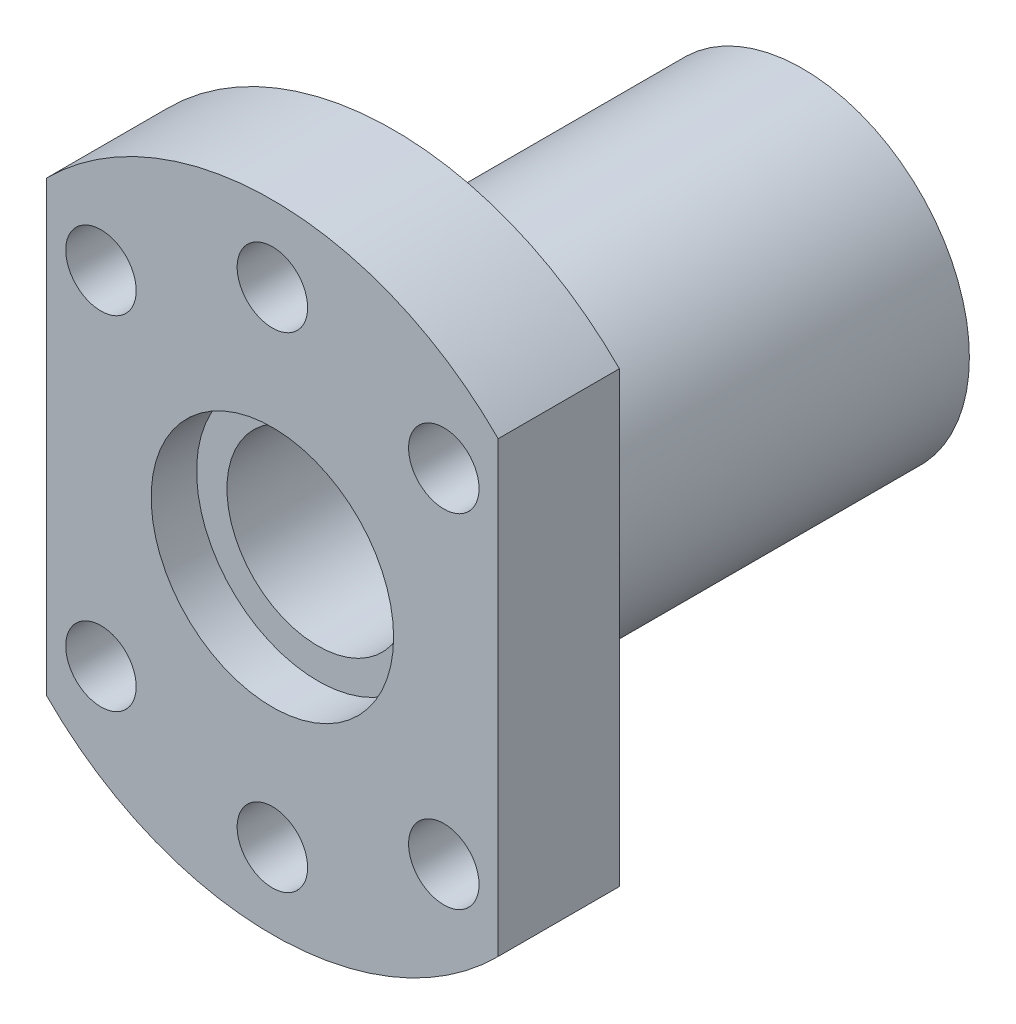
ISO-10303-21;
HEADER;
FILE_DESCRIPTION(('STEP AP214'),'2;1');
FILE_NAME('part.step','',(''),(''),'','','');
FILE_SCHEMA(('AUTOMOTIVE_DESIGN { 1 0 10303 214 1 1 1 1 }'));
ENDSEC;
DATA;
#1=APPLICATION_CONTEXT('core data for automotive mechanical design processes');
#2=APPLICATION_PROTOCOL_DEFINITION('international standard','automotive_design',2000,#1);
#3=PRODUCT_CONTEXT('',#1,'mechanical');
#4=PRODUCT('Part','Part','',(#3));
#5=PRODUCT_RELATED_PRODUCT_CATEGORY('part','',(#4));
#6=PRODUCT_DEFINITION_FORMATION('','',#4);
#7=PRODUCT_DEFINITION_CONTEXT('part definition',#1,'design');
#8=PRODUCT_DEFINITION('design','',#6,#7);
#9=PRODUCT_DEFINITION_SHAPE('','',#8);
#10=(LENGTH_UNIT() NAMED_UNIT(*) SI_UNIT(.MILLI.,.METRE.));
#11=(NAMED_UNIT(*) PLANE_ANGLE_UNIT() SI_UNIT($,.RADIAN.));
#12=(NAMED_UNIT(*) SI_UNIT($,.STERADIAN.) SOLID_ANGLE_UNIT());
#13=UNCERTAINTY_MEASURE_WITH_UNIT(LENGTH_MEASURE(1.E-05),#10,'distance_accuracy_value','');
#14=(GEOMETRIC_REPRESENTATION_CONTEXT(3) GLOBAL_UNCERTAINTY_ASSIGNED_CONTEXT((#13)) GLOBAL_UNIT_ASSIGNED_CONTEXT((#10,
#11,#12)) REPRESENTATION_CONTEXT('',''));
#15=CARTESIAN_POINT('',(0.,0.,0.));
#16=DIRECTION('',(0.,0.,1.));
#17=DIRECTION('',(1.,0.,0.));
#18=AXIS2_PLACEMENT_3D('',#15,#16,#17);
#19=CARTESIAN_POINT('',(0.,0.,27.));
#20=DIRECTION('',(0.,0.,1.));
#21=DIRECTION('',(1.,0.,0.));
#22=AXIS2_PLACEMENT_3D('',#19,#20,#21);
#23=CYLINDRICAL_SURFACE('',#22,21.);
#24=CARTESIAN_POINT('',(0.,0.,9.5));
#25=DIRECTION('',(0.,0.,1.));
#26=DIRECTION('',(1.,0.,0.));
#27=AXIS2_PLACEMENT_3D('',#24,#25,#26);
#28=CIRCLE('',#27,21.);
#29=CARTESIAN_POINT('',(-14.9,-14.7983107144025,9.5));
#30=VERTEX_POINT('',#29);
#31=CARTESIAN_POINT('',(14.9,-14.7983107144025,9.5));
#32=VERTEX_POINT('',#31);
#33=EDGE_CURVE('E93',#30,#32,#28,.T.);
#34=ORIENTED_EDGE('',*,*,#33,.T.);
#35=DIRECTION('',(0.,0.,1.));
#36=VECTOR('',#35,1.);
#37=CARTESIAN_POINT('',(14.9,-14.7983107144025,27.));
#38=LINE('',#37,#36);
#39=CARTESIAN_POINT('',(14.9,-14.7983107144025,17.5));
#40=VERTEX_POINT('',#39);
#41=EDGE_CURVE('E54',#32,#40,#38,.T.);
#42=ORIENTED_EDGE('',*,*,#41,.T.);
#43=CARTESIAN_POINT('',(0.,0.,17.5));
#44=DIRECTION('',(0.,0.,1.));
#45=DIRECTION('',(1.,0.,0.));
#46=AXIS2_PLACEMENT_3D('',#43,#44,#45);
#47=CIRCLE('',#46,21.);
#48=CARTESIAN_POINT('',(-14.9,-14.7983107144025,17.5));
#49=VERTEX_POINT('',#48);
#50=EDGE_CURVE('E91',#49,#40,#47,.T.);
#51=ORIENTED_EDGE('',*,*,#50,.F.);
#52=DIRECTION('',(0.,0.,1.));
#53=VECTOR('',#52,1.);
#54=CARTESIAN_POINT('',(-14.9,-14.7983107144025,27.));
#55=LINE('',#54,#53);
#56=EDGE_CURVE('E153',#49,#30,#55,.F.);
#57=ORIENTED_EDGE('',*,*,#56,.T.);
#58=EDGE_LOOP('',(#34,#42,#51,#57));
#59=FACE_BOUND('',#58,.T.);
#60=ADVANCED_FACE('F37',(#59),#23,.T.);
#61=CARTESIAN_POINT('',(0.,11.,-17.5));
#62=DIRECTION('',(0.,0.,1.));
#63=DIRECTION('',(1.,0.,0.));
#64=AXIS2_PLACEMENT_3D('',#61,#62,#63);
#65=PLANE('',#64);
#66=CARTESIAN_POINT('',(0.,0.,-17.5));
#67=DIRECTION('',(0.,0.,1.));
#68=DIRECTION('',(1.,0.,0.));
#69=AXIS2_PLACEMENT_3D('',#66,#67,#68);
#70=CIRCLE('',#69,11.);
#71=CARTESIAN_POINT('',(11.,0.,-17.5));
#72=VERTEX_POINT('',#71);
#73=EDGE_CURVE('E157',#72,#72,#70,.T.);
#74=ORIENTED_EDGE('',*,*,#73,.F.);
#75=EDGE_LOOP('',(#74));
#76=FACE_BOUND('',#75,.T.);
#77=CARTESIAN_POINT('',(0.,0.,-17.5));
#78=DIRECTION('',(0.,0.,1.));
#79=DIRECTION('',(1.,0.,0.));
#80=AXIS2_PLACEMENT_3D('',#77,#78,#79);
#81=CIRCLE('',#80,8.);
#82=CARTESIAN_POINT('',(8.,0.,-17.5));
#83=VERTEX_POINT('',#82);
#84=EDGE_CURVE('E119',#83,#83,#81,.T.);
#85=ORIENTED_EDGE('',*,*,#84,.T.);
#86=EDGE_LOOP('',(#85));
#87=FACE_BOUND('',#86,.T.);
#88=ADVANCED_FACE('F39',(#76,#87),#65,.F.);
#89=CARTESIAN_POINT('',(0.,0.,27.));
#90=DIRECTION('',(0.,0.,1.));
#91=DIRECTION('',(1.,0.,0.));
#92=AXIS2_PLACEMENT_3D('',#89,#90,#91);
#93=CYLINDRICAL_SURFACE('',#92,8.);
#94=ORIENTED_EDGE('',*,*,#84,.F.);
#95=EDGE_LOOP('',(#94));
#96=FACE_BOUND('',#95,.T.);
#97=CARTESIAN_POINT('',(0.,0.,-14.5));
#98=DIRECTION('',(0.,0.,1.));
#99=DIRECTION('',(1.,0.,0.));
#100=AXIS2_PLACEMENT_3D('',#97,#98,#99);
#101=CIRCLE('',#100,8.);
#102=CARTESIAN_POINT('',(8.,0.,-14.5));
#103=VERTEX_POINT('',#102);
#104=EDGE_CURVE('E116',#103,#103,#101,.T.);
#105=ORIENTED_EDGE('',*,*,#104,.T.);
#106=EDGE_LOOP('',(#105));
#107=FACE_BOUND('',#106,.T.);
#108=ADVANCED_FACE('F174',(#96,#107),#93,.F.);
#109=CARTESIAN_POINT('',(0.,6.,-14.5));
#110=DIRECTION('',(0.,0.,1.));
#111=DIRECTION('',(1.,0.,0.));
#112=AXIS2_PLACEMENT_3D('',#109,#110,#111);
#113=PLANE('',#112);
#114=ORIENTED_EDGE('',*,*,#104,.F.);
#115=EDGE_LOOP('',(#114));
#116=FACE_BOUND('',#115,.T.);
#117=CARTESIAN_POINT('',(0.,0.,-14.5));
#118=DIRECTION('',(0.,0.,1.));
#119=DIRECTION('',(1.,0.,0.));
#120=AXIS2_PLACEMENT_3D('',#117,#118,#119);
#121=CIRCLE('',#120,6.);
#122=CARTESIAN_POINT('',(6.,0.,-14.5));
#123=VERTEX_POINT('',#122);
#124=EDGE_CURVE('E113',#123,#123,#121,.T.);
#125=ORIENTED_EDGE('',*,*,#124,.T.);
#126=EDGE_LOOP('',(#125));
#127=FACE_BOUND('',#126,.T.);
#128=ADVANCED_FACE('F179',(#116,#127),#113,.F.);
#129=CARTESIAN_POINT('',(0.,0.,27.));
#130=DIRECTION('',(0.,0.,1.));
#131=DIRECTION('',(1.,0.,0.));
#132=AXIS2_PLACEMENT_3D('',#129,#130,#131);
#133=CYLINDRICAL_SURFACE('',#132,6.);
#134=ORIENTED_EDGE('',*,*,#124,.F.);
#135=EDGE_LOOP('',(#134));
#136=FACE_BOUND('',#135,.T.);
#137=CARTESIAN_POINT('',(0.,0.,14.5));
#138=DIRECTION('',(0.,0.,1.));
#139=DIRECTION('',(1.,0.,0.));
#140=AXIS2_PLACEMENT_3D('',#137,#138,#139);
#141=CIRCLE('',#140,6.);
#142=CARTESIAN_POINT('',(6.,0.,14.5));
#143=VERTEX_POINT('',#142);
#144=EDGE_CURVE('E110',#143,#143,#141,.T.);
#145=ORIENTED_EDGE('',*,*,#144,.T.);
#146=EDGE_LOOP('',(#145));
#147=FACE_BOUND('',#146,.T.);
#148=ADVANCED_FACE('F184',(#136,#147),#133,.F.);
#149=CARTESIAN_POINT('',(0.,6.,14.5));
#150=DIRECTION('',(0.,0.,-1.));
#151=DIRECTION('',(-1.,0.,0.));
#152=AXIS2_PLACEMENT_3D('',#149,#150,#151);
#153=PLANE('',#152);
#154=ORIENTED_EDGE('',*,*,#144,.F.);
#155=EDGE_LOOP('',(#154));
#156=FACE_BOUND('',#155,.T.);
#157=CARTESIAN_POINT('',(0.,0.,14.5));
#158=DIRECTION('',(0.,0.,1.));
#159=DIRECTION('',(1.,0.,0.));
#160=AXIS2_PLACEMENT_3D('',#157,#158,#159);
#161=CIRCLE('',#160,8.);
#162=CARTESIAN_POINT('',(8.,0.,14.5));
#163=VERTEX_POINT('',#162);
#164=EDGE_CURVE('E103',#163,#163,#161,.T.);
#165=ORIENTED_EDGE('',*,*,#164,.T.);
#166=EDGE_LOOP('',(#165));
#167=FACE_BOUND('',#166,.T.);
#168=ADVANCED_FACE('F190',(#156,#167),#153,.F.);
#169=CARTESIAN_POINT('',(0.,0.,27.));
#170=DIRECTION('',(0.,0.,1.));
#171=DIRECTION('',(1.,0.,0.));
#172=AXIS2_PLACEMENT_3D('',#169,#170,#171);
#173=CYLINDRICAL_SURFACE('',#172,8.);
#174=ORIENTED_EDGE('',*,*,#164,.F.);
#175=EDGE_LOOP('',(#174));
#176=FACE_BOUND('',#175,.T.);
#177=CARTESIAN_POINT('',(0.,0.,17.5));
#178=DIRECTION('',(0.,0.,1.));
#179=DIRECTION('',(1.,0.,0.));
#180=AXIS2_PLACEMENT_3D('',#177,#178,#179);
#181=CIRCLE('',#180,8.);
#182=CARTESIAN_POINT('',(8.,0.,17.5));
#183=VERTEX_POINT('',#182);
#184=EDGE_CURVE('E99',#183,#183,#181,.T.);
#185=ORIENTED_EDGE('',*,*,#184,.T.);
#186=EDGE_LOOP('',(#185));
#187=FACE_BOUND('',#186,.T.);
#188=ADVANCED_FACE('F196',(#176,#187),#173,.F.);
#189=CARTESIAN_POINT('',(0.,8.,17.5));
#190=DIRECTION('',(0.,0.,-1.));
#191=DIRECTION('',(-1.,0.,0.));
#192=AXIS2_PLACEMENT_3D('',#189,#190,#191);
#193=PLANE('',#192);
#194=CARTESIAN_POINT('',(11.3137084989848,11.3137084989848,17.5));
#195=DIRECTION('',(0.,0.,1.));
#196=DIRECTION('',(1.,0.,0.));
#197=AXIS2_PLACEMENT_3D('',#194,#195,#196);
#198=CIRCLE('',#197,2.325);
#199=CARTESIAN_POINT('',(13.6387084989848,11.3137084989848,17.5));
#200=VERTEX_POINT('',#199);
#201=EDGE_CURVE('E131',#200,#200,#198,.T.);
#202=ORIENTED_EDGE('',*,*,#201,.F.);
#203=EDGE_LOOP('',(#202));
#204=FACE_BOUND('',#203,.T.);
#205=CARTESIAN_POINT('',(11.3137084989848,-11.3137084989848,17.5));
#206=DIRECTION('',(0.,0.,1.));
#207=DIRECTION('',(1.,0.,0.));
#208=AXIS2_PLACEMENT_3D('',#205,#206,#207);
#209=CIRCLE('',#208,2.325);
#210=CARTESIAN_POINT('',(13.6387084989848,-11.3137084989848,17.5));
#211=VERTEX_POINT('',#210);
#212=EDGE_CURVE('E252',#211,#211,#209,.T.);
#213=ORIENTED_EDGE('',*,*,#212,.F.);
#214=EDGE_LOOP('',(#213));
#215=FACE_BOUND('',#214,.T.);
#216=CARTESIAN_POINT('',(0.,-16.,17.5));
#217=DIRECTION('',(0.,0.,1.));
#218=DIRECTION('',(1.,0.,0.));
#219=AXIS2_PLACEMENT_3D('',#216,#217,#218);
#220=CIRCLE('',#219,2.325);
#221=CARTESIAN_POINT('',(2.325,-16.,17.5));
#222=VERTEX_POINT('',#221);
#223=EDGE_CURVE('E255',#222,#222,#220,.T.);
#224=ORIENTED_EDGE('',*,*,#223,.F.);
#225=EDGE_LOOP('',(#224));
#226=FACE_BOUND('',#225,.T.);
#227=CARTESIAN_POINT('',(-11.3137084989848,-11.3137084989848,17.5));
#228=DIRECTION('',(0.,0.,1.));
#229=DIRECTION('',(1.,0.,0.));
#230=AXIS2_PLACEMENT_3D('',#227,#228,#229);
#231=CIRCLE('',#230,2.325);
#232=CARTESIAN_POINT('',(-8.98870849898476,-11.3137084989848,17.5));
#233=VERTEX_POINT('',#232);
#234=EDGE_CURVE('E259',#233,#233,#231,.T.);
#235=ORIENTED_EDGE('',*,*,#234,.F.);
#236=EDGE_LOOP('',(#235));
#237=FACE_BOUND('',#236,.T.);
#238=CARTESIAN_POINT('',(-11.3137084989848,11.3137084989848,17.5));
#239=DIRECTION('',(0.,0.,1.));
#240=DIRECTION('',(1.,0.,0.));
#241=AXIS2_PLACEMENT_3D('',#238,#239,#240);
#242=CIRCLE('',#241,2.325);
#243=CARTESIAN_POINT('',(-8.98870849898476,11.3137084989848,17.5));
#244=VERTEX_POINT('',#243);
#245=EDGE_CURVE('E148',#244,#244,#242,.T.);
#246=ORIENTED_EDGE('',*,*,#245,.F.);
#247=EDGE_LOOP('',(#246));
#248=FACE_BOUND('',#247,.T.);
#249=CARTESIAN_POINT('',(0.,16.,17.5));
#250=DIRECTION('',(0.,0.,1.));
#251=DIRECTION('',(1.,0.,0.));
#252=AXIS2_PLACEMENT_3D('',#249,#250,#251);
#253=CIRCLE('',#252,2.325);
#254=CARTESIAN_POINT('',(2.325,16.,17.5));
#255=VERTEX_POINT('',#254);
#256=EDGE_CURVE('E126',#255,#255,#253,.T.);
#257=ORIENTED_EDGE('',*,*,#256,.F.);
#258=EDGE_LOOP('',(#257));
#259=FACE_BOUND('',#258,.T.);
#260=ORIENTED_EDGE('',*,*,#184,.F.);
#261=EDGE_LOOP('',(#260));
#262=FACE_BOUND('',#261,.T.);
#263=ORIENTED_EDGE('',*,*,#50,.T.);
#264=DIRECTION('',(0.,1.,0.));
#265=VECTOR('',#264,1.);
#266=CARTESIAN_POINT('',(14.9,-21.,17.5));
#267=LINE('',#266,#265);
#268=CARTESIAN_POINT('',(14.9,14.7983107144025,17.5));
#269=VERTEX_POINT('',#268);
#270=EDGE_CURVE('E79',#40,#269,#267,.T.);
#271=ORIENTED_EDGE('',*,*,#270,.T.);
#272=CARTESIAN_POINT('',(-14.9,14.7983107144025,17.5));
#273=VERTEX_POINT('',#272);
#274=EDGE_CURVE('E100',#269,#273,#47,.T.);
#275=ORIENTED_EDGE('',*,*,#274,.T.);
#276=DIRECTION('',(0.,1.,0.));
#277=VECTOR('',#276,1.);
#278=CARTESIAN_POINT('',(-14.9,-21.,17.5));
#279=LINE('',#278,#277);
#280=EDGE_CURVE('E94',#49,#273,#279,.T.);
#281=ORIENTED_EDGE('',*,*,#280,.F.);
#282=EDGE_LOOP('',(#263,#271,#275,#281));
#283=FACE_BOUND('',#282,.T.);
#284=ADVANCED_FACE('F97',(#204,#215,#226,#237,#248,#259,#262,#283),#193,.F.);
#285=ORIENTED_EDGE('',*,*,#274,.F.);
#286=DIRECTION('',(0.,0.,1.));
#287=VECTOR('',#286,1.);
#288=CARTESIAN_POINT('',(14.9,14.7983107144025,27.));
#289=LINE('',#288,#287);
#290=CARTESIAN_POINT('',(14.9,14.7983107144025,9.5));
#291=VERTEX_POINT('',#290);
#292=EDGE_CURVE('E81',#269,#291,#289,.F.);
#293=ORIENTED_EDGE('',*,*,#292,.T.);
#294=CARTESIAN_POINT('',(-14.9,14.7983107144025,9.5));
#295=VERTEX_POINT('',#294);
#296=EDGE_CURVE('E61',#291,#295,#28,.T.);
#297=ORIENTED_EDGE('',*,*,#296,.T.);
#298=DIRECTION('',(0.,0.,1.));
#299=VECTOR('',#298,1.);
#300=CARTESIAN_POINT('',(-14.9,14.7983107144025,27.));
#301=LINE('',#300,#299);
#302=EDGE_CURVE('E155',#295,#273,#301,.T.);
#303=ORIENTED_EDGE('',*,*,#302,.T.);
#304=EDGE_LOOP('',(#285,#293,#297,#303));
#305=FACE_BOUND('',#304,.T.);
#306=ADVANCED_FACE('F206',(#305),#23,.T.);
#307=CARTESIAN_POINT('',(0.,21.,9.5));
#308=DIRECTION('',(0.,0.,1.));
#309=DIRECTION('',(1.,0.,0.));
#310=AXIS2_PLACEMENT_3D('',#307,#308,#309);
#311=PLANE('',#310);
#312=CARTESIAN_POINT('',(11.3137084989848,11.3137084989848,9.5));
#313=DIRECTION('',(0.,0.,1.));
#314=DIRECTION('',(1.,0.,0.));
#315=AXIS2_PLACEMENT_3D('',#312,#313,#314);
#316=CIRCLE('',#315,2.325);
#317=CARTESIAN_POINT('',(13.6387084989848,11.3137084989848,9.5));
#318=VERTEX_POINT('',#317);
#319=EDGE_CURVE('E41',#318,#318,#316,.T.);
#320=ORIENTED_EDGE('',*,*,#319,.T.);
#321=EDGE_LOOP('',(#320));
#322=FACE_BOUND('',#321,.T.);
#323=CARTESIAN_POINT('',(11.3137084989848,-11.3137084989848,9.5));
#324=DIRECTION('',(0.,0.,1.));
#325=DIRECTION('',(1.,0.,0.));
#326=AXIS2_PLACEMENT_3D('',#323,#324,#325);
#327=CIRCLE('',#326,2.325);
#328=CARTESIAN_POINT('',(13.6387084989848,-11.3137084989848,9.5));
#329=VERTEX_POINT('',#328);
#330=EDGE_CURVE('E136',#329,#329,#327,.T.);
#331=ORIENTED_EDGE('',*,*,#330,.T.);
#332=EDGE_LOOP('',(#331));
#333=FACE_BOUND('',#332,.T.);
#334=CARTESIAN_POINT('',(0.,-16.,9.5));
#335=DIRECTION('',(0.,0.,1.));
#336=DIRECTION('',(1.,0.,0.));
#337=AXIS2_PLACEMENT_3D('',#334,#335,#336);
#338=CIRCLE('',#337,2.325);
#339=CARTESIAN_POINT('',(2.325,-16.,9.5));
#340=VERTEX_POINT('',#339);
#341=EDGE_CURVE('E134',#340,#340,#338,.T.);
#342=ORIENTED_EDGE('',*,*,#341,.T.);
#343=EDGE_LOOP('',(#342));
#344=FACE_BOUND('',#343,.T.);
#345=CARTESIAN_POINT('',(-11.3137084989848,-11.3137084989848,9.5));
#346=DIRECTION('',(0.,0.,1.));
#347=DIRECTION('',(1.,0.,0.));
#348=AXIS2_PLACEMENT_3D('',#345,#346,#347);
#349=CIRCLE('',#348,2.325);
#350=CARTESIAN_POINT('',(-8.98870849898476,-11.3137084989848,9.5));
#351=VERTEX_POINT('',#350);
#352=EDGE_CURVE('E130',#351,#351,#349,.T.);
#353=ORIENTED_EDGE('',*,*,#352,.T.);
#354=EDGE_LOOP('',(#353));
#355=FACE_BOUND('',#354,.T.);
#356=CARTESIAN_POINT('',(-11.3137084989848,11.3137084989848,9.5));
#357=DIRECTION('',(0.,0.,1.));
#358=DIRECTION('',(1.,0.,0.));
#359=AXIS2_PLACEMENT_3D('',#356,#357,#358);
#360=CIRCLE('',#359,2.325);
#361=CARTESIAN_POINT('',(-8.98870849898476,11.3137084989848,9.5));
#362=VERTEX_POINT('',#361);
#363=EDGE_CURVE('E127',#362,#362,#360,.T.);
#364=ORIENTED_EDGE('',*,*,#363,.T.);
#365=EDGE_LOOP('',(#364));
#366=FACE_BOUND('',#365,.T.);
#367=CARTESIAN_POINT('',(0.,16.,9.5));
#368=DIRECTION('',(0.,0.,1.));
#369=DIRECTION('',(1.,0.,0.));
#370=AXIS2_PLACEMENT_3D('',#367,#368,#369);
#371=CIRCLE('',#370,2.325);
#372=CARTESIAN_POINT('',(2.325,16.,9.5));
#373=VERTEX_POINT('',#372);
#374=EDGE_CURVE('E85',#373,#373,#371,.T.);
#375=ORIENTED_EDGE('',*,*,#374,.T.);
#376=EDGE_LOOP('',(#375));
#377=FACE_BOUND('',#376,.T.);
#378=ORIENTED_EDGE('',*,*,#296,.F.);
#379=DIRECTION('',(0.,-1.,0.));
#380=VECTOR('',#379,1.);
#381=CARTESIAN_POINT('',(14.9,21.,9.5));
#382=LINE('',#381,#380);
#383=EDGE_CURVE('E11',#291,#32,#382,.T.);
#384=ORIENTED_EDGE('',*,*,#383,.T.);
#385=ORIENTED_EDGE('',*,*,#33,.F.);
#386=DIRECTION('',(0.,1.,0.));
#387=VECTOR('',#386,1.);
#388=CARTESIAN_POINT('',(-14.9,21.,9.5));
#389=LINE('',#388,#387);
#390=EDGE_CURVE('E46',#30,#295,#389,.T.);
#391=ORIENTED_EDGE('',*,*,#390,.T.);
#392=EDGE_LOOP('',(#378,#384,#385,#391));
#393=FACE_BOUND('',#392,.T.);
#394=CARTESIAN_POINT('',(0.,0.,9.5));
#395=DIRECTION('',(0.,0.,1.));
#396=DIRECTION('',(1.,0.,0.));
#397=AXIS2_PLACEMENT_3D('',#394,#395,#396);
#398=CIRCLE('',#397,11.);
#399=CARTESIAN_POINT('',(11.,0.,9.5));
#400=VERTEX_POINT('',#399);
#401=EDGE_CURVE('E159',#400,#400,#398,.T.);
#402=ORIENTED_EDGE('',*,*,#401,.T.);
#403=EDGE_LOOP('',(#402));
#404=FACE_BOUND('',#403,.T.);
#405=ADVANCED_FACE('F163',(#322,#333,#344,#355,#366,#377,#393,#404),#311,.F.);
#406=CARTESIAN_POINT('',(0.,0.,27.));
#407=DIRECTION('',(0.,0.,1.));
#408=DIRECTION('',(1.,0.,0.));
#409=AXIS2_PLACEMENT_3D('',#406,#407,#408);
#410=CYLINDRICAL_SURFACE('',#409,11.);
#411=ORIENTED_EDGE('',*,*,#401,.F.);
#412=EDGE_LOOP('',(#411));
#413=FACE_BOUND('',#412,.T.);
#414=ORIENTED_EDGE('',*,*,#73,.T.);
#415=EDGE_LOOP('',(#414));
#416=FACE_BOUND('',#415,.T.);
#417=ADVANCED_FACE('F165',(#413,#416),#410,.T.);
#418=CARTESIAN_POINT('',(-14.9,-21.,9.5));
#419=DIRECTION('',(1.,0.,0.));
#420=DIRECTION('',(0.,0.,-1.));
#421=AXIS2_PLACEMENT_3D('',#418,#419,#420);
#422=PLANE('',#421);
#423=ORIENTED_EDGE('',*,*,#390,.F.);
#424=ORIENTED_EDGE('',*,*,#56,.F.);
#425=ORIENTED_EDGE('',*,*,#280,.T.);
#426=ORIENTED_EDGE('',*,*,#302,.F.);
#427=EDGE_LOOP('',(#423,#424,#425,#426));
#428=FACE_BOUND('',#427,.T.);
#429=ADVANCED_FACE('F168',(#428),#422,.F.);
#430=CARTESIAN_POINT('',(14.9,-21.,9.5));
#431=DIRECTION('',(-1.,0.,0.));
#432=DIRECTION('',(0.,0.,1.));
#433=AXIS2_PLACEMENT_3D('',#430,#431,#432);
#434=PLANE('',#433);
#435=ORIENTED_EDGE('',*,*,#383,.F.);
#436=ORIENTED_EDGE('',*,*,#292,.F.);
#437=ORIENTED_EDGE('',*,*,#270,.F.);
#438=ORIENTED_EDGE('',*,*,#41,.F.);
#439=EDGE_LOOP('',(#435,#436,#437,#438));
#440=FACE_BOUND('',#439,.T.);
#441=ADVANCED_FACE('F80',(#440),#434,.F.);
#442=CARTESIAN_POINT('',(0.,16.,7.5));
#443=DIRECTION('',(0.,0.,1.));
#444=DIRECTION('',(1.,0.,0.));
#445=AXIS2_PLACEMENT_3D('',#442,#443,#444);
#446=CYLINDRICAL_SURFACE('',#445,2.325);
#447=ORIENTED_EDGE('',*,*,#256,.T.);
#448=EDGE_LOOP('',(#447));
#449=FACE_BOUND('',#448,.T.);
#450=ORIENTED_EDGE('',*,*,#374,.F.);
#451=EDGE_LOOP('',(#450));
#452=FACE_BOUND('',#451,.T.);
#453=ADVANCED_FACE('F226',(#449,#452),#446,.F.);
#454=CARTESIAN_POINT('',(-11.3137084989848,11.3137084989848,7.5));
#455=DIRECTION('',(0.,0.,1.));
#456=DIRECTION('',(1.,0.,0.));
#457=AXIS2_PLACEMENT_3D('',#454,#455,#456);
#458=CYLINDRICAL_SURFACE('',#457,2.325);
#459=ORIENTED_EDGE('',*,*,#245,.T.);
#460=EDGE_LOOP('',(#459));
#461=FACE_BOUND('',#460,.T.);
#462=ORIENTED_EDGE('',*,*,#363,.F.);
#463=EDGE_LOOP('',(#462));
#464=FACE_BOUND('',#463,.T.);
#465=ADVANCED_FACE('F229',(#461,#464),#458,.F.);
#466=CARTESIAN_POINT('',(-11.3137084989848,-11.3137084989848,7.5));
#467=DIRECTION('',(0.,0.,1.));
#468=DIRECTION('',(1.,0.,0.));
#469=AXIS2_PLACEMENT_3D('',#466,#467,#468);
#470=CYLINDRICAL_SURFACE('',#469,2.325);
#471=ORIENTED_EDGE('',*,*,#234,.T.);
#472=EDGE_LOOP('',(#471));
#473=FACE_BOUND('',#472,.T.);
#474=ORIENTED_EDGE('',*,*,#352,.F.);
#475=EDGE_LOOP('',(#474));
#476=FACE_BOUND('',#475,.T.);
#477=ADVANCED_FACE('F232',(#473,#476),#470,.F.);
#478=CARTESIAN_POINT('',(0.,-16.,7.5));
#479=DIRECTION('',(0.,0.,1.));
#480=DIRECTION('',(1.,0.,0.));
#481=AXIS2_PLACEMENT_3D('',#478,#479,#480);
#482=CYLINDRICAL_SURFACE('',#481,2.325);
#483=ORIENTED_EDGE('',*,*,#223,.T.);
#484=EDGE_LOOP('',(#483));
#485=FACE_BOUND('',#484,.T.);
#486=ORIENTED_EDGE('',*,*,#341,.F.);
#487=EDGE_LOOP('',(#486));
#488=FACE_BOUND('',#487,.T.);
#489=ADVANCED_FACE('F236',(#485,#488),#482,.F.);
#490=CARTESIAN_POINT('',(11.3137084989848,-11.3137084989848,7.5));
#491=DIRECTION('',(0.,0.,1.));
#492=DIRECTION('',(1.,0.,0.));
#493=AXIS2_PLACEMENT_3D('',#490,#491,#492);
#494=CYLINDRICAL_SURFACE('',#493,2.325);
#495=ORIENTED_EDGE('',*,*,#212,.T.);
#496=EDGE_LOOP('',(#495));
#497=FACE_BOUND('',#496,.T.);
#498=ORIENTED_EDGE('',*,*,#330,.F.);
#499=EDGE_LOOP('',(#498));
#500=FACE_BOUND('',#499,.T.);
#501=ADVANCED_FACE('F240',(#497,#500),#494,.F.);
#502=CARTESIAN_POINT('',(11.3137084989848,11.3137084989848,7.5));
#503=DIRECTION('',(0.,0.,1.));
#504=DIRECTION('',(1.,0.,0.));
#505=AXIS2_PLACEMENT_3D('',#502,#503,#504);
#506=CYLINDRICAL_SURFACE('',#505,2.325);
#507=ORIENTED_EDGE('',*,*,#201,.T.);
#508=EDGE_LOOP('',(#507));
#509=FACE_BOUND('',#508,.T.);
#510=ORIENTED_EDGE('',*,*,#319,.F.);
#511=EDGE_LOOP('',(#510));
#512=FACE_BOUND('',#511,.T.);
#513=ADVANCED_FACE('F244',(#509,#512),#506,.F.);
#514=CLOSED_SHELL('',(#60,#88,#108,#128,#148,#168,#188,#284,#306,#405,#417,#429,#441,#453,#465,
#477,#489,#501,#513));
#515=MANIFOLD_SOLID_BREP('B2',#514);
#516=ADVANCED_BREP_SHAPE_REPRESENTATION('',(#18,#515),#14);
#517=SHAPE_DEFINITION_REPRESENTATION(#9,#516);
ENDSEC;
END-ISO-10303-21;
